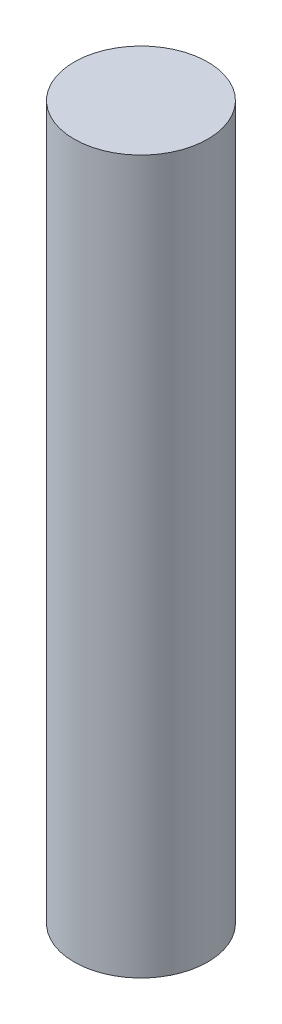
ISO-10303-21;
HEADER;
FILE_DESCRIPTION(('STEP AP214'),'2;1');
FILE_NAME('part.step','',(''),(''),'','','');
FILE_SCHEMA(('AUTOMOTIVE_DESIGN { 1 0 10303 214 1 1 1 1 }'));
ENDSEC;
DATA;
#1=APPLICATION_CONTEXT('core data for automotive mechanical design processes');
#2=APPLICATION_PROTOCOL_DEFINITION('international standard','automotive_design',2000,#1);
#3=PRODUCT_CONTEXT('',#1,'mechanical');
#4=PRODUCT('Part','Part','',(#3));
#5=PRODUCT_RELATED_PRODUCT_CATEGORY('part','',(#4));
#6=PRODUCT_DEFINITION_FORMATION('','',#4);
#7=PRODUCT_DEFINITION_CONTEXT('part definition',#1,'design');
#8=PRODUCT_DEFINITION('design','',#6,#7);
#9=PRODUCT_DEFINITION_SHAPE('','',#8);
#10=(LENGTH_UNIT() NAMED_UNIT(*) SI_UNIT(.MILLI.,.METRE.));
#11=(NAMED_UNIT(*) PLANE_ANGLE_UNIT() SI_UNIT($,.RADIAN.));
#12=(NAMED_UNIT(*) SI_UNIT($,.STERADIAN.) SOLID_ANGLE_UNIT());
#13=UNCERTAINTY_MEASURE_WITH_UNIT(LENGTH_MEASURE(1.E-05),#10,'distance_accuracy_value','');
#14=(GEOMETRIC_REPRESENTATION_CONTEXT(3) GLOBAL_UNCERTAINTY_ASSIGNED_CONTEXT((#13)) GLOBAL_UNIT_ASSIGNED_CONTEXT((#10,
#11,#12)) REPRESENTATION_CONTEXT('',''));
#15=CARTESIAN_POINT('',(0.,0.,0.));
#16=DIRECTION('',(0.,0.,1.));
#17=DIRECTION('',(1.,0.,0.));
#18=AXIS2_PLACEMENT_3D('',#15,#16,#17);
#19=CARTESIAN_POINT('',(0.,8.,0.));
#20=DIRECTION('',(0.,-1.,0.));
#21=DIRECTION('',(0.,0.,-1.));
#22=AXIS2_PLACEMENT_3D('',#19,#20,#21);
#23=CYLINDRICAL_SURFACE('',#22,1.5);
#24=CARTESIAN_POINT('',(0.,8.,0.));
#25=DIRECTION('',(0.,1.,0.));
#26=DIRECTION('',(0.,0.,1.));
#27=AXIS2_PLACEMENT_3D('',#24,#25,#26);
#28=CIRCLE('',#27,1.5);
#29=CARTESIAN_POINT('',(0.,8.,1.5));
#30=VERTEX_POINT('',#29);
#31=EDGE_CURVE('E10',#30,#30,#28,.T.);
#32=ORIENTED_EDGE('',*,*,#31,.F.);
#33=EDGE_LOOP('',(#32));
#34=FACE_BOUND('',#33,.T.);
#35=CARTESIAN_POINT('',(0.,-8.,0.));
#36=DIRECTION('',(0.,1.,0.));
#37=DIRECTION('',(0.,0.,1.));
#38=AXIS2_PLACEMENT_3D('',#35,#36,#37);
#39=CIRCLE('',#38,1.5);
#40=CARTESIAN_POINT('',(0.,-8.,1.5));
#41=VERTEX_POINT('',#40);
#42=EDGE_CURVE('E31',#41,#41,#39,.T.);
#43=ORIENTED_EDGE('',*,*,#42,.T.);
#44=EDGE_LOOP('',(#43));
#45=FACE_BOUND('',#44,.T.);
#46=ADVANCED_FACE('F28',(#34,#45),#23,.T.);
#47=CARTESIAN_POINT('',(0.,8.,0.));
#48=DIRECTION('',(0.,1.,0.));
#49=DIRECTION('',(0.,0.,1.));
#50=AXIS2_PLACEMENT_3D('',#47,#48,#49);
#51=PLANE('',#50);
#52=ORIENTED_EDGE('',*,*,#31,.T.);
#53=EDGE_LOOP('',(#52));
#54=FACE_BOUND('',#53,.T.);
#55=ADVANCED_FACE('F43',(#54),#51,.T.);
#56=CARTESIAN_POINT('',(0.,-8.,0.));
#57=DIRECTION('',(0.,1.,0.));
#58=DIRECTION('',(0.,0.,1.));
#59=AXIS2_PLACEMENT_3D('',#56,#57,#58);
#60=PLANE('',#59);
#61=ORIENTED_EDGE('',*,*,#42,.F.);
#62=EDGE_LOOP('',(#61));
#63=FACE_BOUND('',#62,.T.);
#64=ADVANCED_FACE('F41',(#63),#60,.F.);
#65=CLOSED_SHELL('',(#46,#55,#64));
#66=MANIFOLD_SOLID_BREP('B2',#65);
#67=ADVANCED_BREP_SHAPE_REPRESENTATION('',(#18,#66),#14);
#68=SHAPE_DEFINITION_REPRESENTATION(#9,#67);
ENDSEC;
END-ISO-10303-21;
